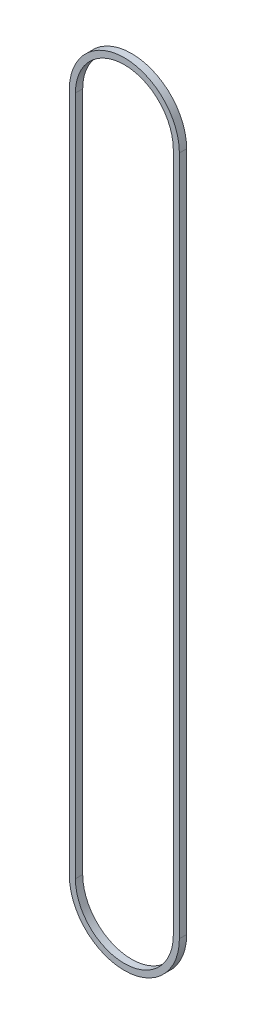
ISO-10303-21;
HEADER;
FILE_DESCRIPTION(('STEP AP214'),'2;1');
FILE_NAME('part.step','',(''),(''),'','','');
FILE_SCHEMA(('AUTOMOTIVE_DESIGN { 1 0 10303 214 1 1 1 1 }'));
ENDSEC;
DATA;
#1=APPLICATION_CONTEXT('core data for automotive mechanical design processes');
#2=APPLICATION_PROTOCOL_DEFINITION('international standard','automotive_design',2000,#1);
#3=PRODUCT_CONTEXT('',#1,'mechanical');
#4=PRODUCT('Part','Part','',(#3));
#5=PRODUCT_RELATED_PRODUCT_CATEGORY('part','',(#4));
#6=PRODUCT_DEFINITION_FORMATION('','',#4);
#7=PRODUCT_DEFINITION_CONTEXT('part definition',#1,'design');
#8=PRODUCT_DEFINITION('design','',#6,#7);
#9=PRODUCT_DEFINITION_SHAPE('','',#8);
#10=(LENGTH_UNIT() NAMED_UNIT(*) SI_UNIT(.MILLI.,.METRE.));
#11=(NAMED_UNIT(*) PLANE_ANGLE_UNIT() SI_UNIT($,.RADIAN.));
#12=(NAMED_UNIT(*) SI_UNIT($,.STERADIAN.) SOLID_ANGLE_UNIT());
#13=UNCERTAINTY_MEASURE_WITH_UNIT(LENGTH_MEASURE(1.E-05),#10,'distance_accuracy_value','');
#14=(GEOMETRIC_REPRESENTATION_CONTEXT(3) GLOBAL_UNCERTAINTY_ASSIGNED_CONTEXT((#13)) GLOBAL_UNIT_ASSIGNED_CONTEXT((#10,
#11,#12)) REPRESENTATION_CONTEXT('',''));
#15=CARTESIAN_POINT('',(0.,0.,0.));
#16=DIRECTION('',(0.,0.,1.));
#17=DIRECTION('',(1.,0.,0.));
#18=AXIS2_PLACEMENT_3D('',#15,#16,#17);
#19=CARTESIAN_POINT('',(0.,0.,7.62));
#20=DIRECTION('',(0.,0.,1.));
#21=DIRECTION('',(1.,0.,0.));
#22=AXIS2_PLACEMENT_3D('',#19,#20,#21);
#23=PLANE('',#22);
#24=CARTESIAN_POINT('',(0.,0.,7.62));
#25=DIRECTION('',(0.,0.,1.));
#26=DIRECTION('',(1.,0.,0.));
#27=AXIS2_PLACEMENT_3D('',#24,#25,#26);
#28=CIRCLE('',#27,57.4929);
#29=CARTESIAN_POINT('',(-57.4929,0.,7.62));
#30=VERTEX_POINT('',#29);
#31=CARTESIAN_POINT('',(57.4929,0.,7.62));
#32=VERTEX_POINT('',#31);
#33=EDGE_CURVE('E159',#30,#32,#28,.T.);
#34=ORIENTED_EDGE('',*,*,#33,.T.);
#35=DIRECTION('',(0.,1.,0.));
#36=VECTOR('',#35,1.);
#37=CARTESIAN_POINT('',(57.4929,0.,7.62));
#38=LINE('',#37,#36);
#39=CARTESIAN_POINT('',(57.4929,711.2,7.62));
#40=VERTEX_POINT('',#39);
#41=EDGE_CURVE('E163',#32,#40,#38,.T.);
#42=ORIENTED_EDGE('',*,*,#41,.T.);
#43=CARTESIAN_POINT('',(0.,711.2,7.62));
#44=DIRECTION('',(0.,0.,1.));
#45=DIRECTION('',(1.,0.,0.));
#46=AXIS2_PLACEMENT_3D('',#43,#44,#45);
#47=CIRCLE('',#46,57.4929);
#48=CARTESIAN_POINT('',(-57.4929,711.2,7.62));
#49=VERTEX_POINT('',#48);
#50=EDGE_CURVE('E167',#40,#49,#47,.T.);
#51=ORIENTED_EDGE('',*,*,#50,.T.);
#52=DIRECTION('',(0.,-1.,0.));
#53=VECTOR('',#52,1.);
#54=CARTESIAN_POINT('',(-57.4929,0.,7.62));
#55=LINE('',#54,#53);
#56=EDGE_CURVE('E170',#49,#30,#55,.T.);
#57=ORIENTED_EDGE('',*,*,#56,.T.);
#58=EDGE_LOOP('',(#34,#42,#51,#57));
#59=FACE_BOUND('',#58,.T.);
#60=DIRECTION('',(0.,1.,0.));
#61=VECTOR('',#60,1.);
#62=CARTESIAN_POINT('',(51.1429,0.,7.62));
#63=LINE('',#62,#61);
#64=CARTESIAN_POINT('',(51.1429,0.,7.62));
#65=VERTEX_POINT('',#64);
#66=CARTESIAN_POINT('',(51.1429,711.2,7.62));
#67=VERTEX_POINT('',#66);
#68=EDGE_CURVE('E120',#65,#67,#63,.T.);
#69=ORIENTED_EDGE('',*,*,#68,.F.);
#70=CARTESIAN_POINT('',(0.,0.,7.62));
#71=DIRECTION('',(0.,0.,1.));
#72=DIRECTION('',(1.,0.,0.));
#73=AXIS2_PLACEMENT_3D('',#70,#71,#72);
#74=CIRCLE('',#73,51.1429);
#75=CARTESIAN_POINT('',(-51.1429,0.,7.62));
#76=VERTEX_POINT('',#75);
#77=EDGE_CURVE('E111',#76,#65,#74,.T.);
#78=ORIENTED_EDGE('',*,*,#77,.F.);
#79=DIRECTION('',(0.,-1.,0.));
#80=VECTOR('',#79,1.);
#81=CARTESIAN_POINT('',(-51.1429,0.,7.62));
#82=LINE('',#81,#80);
#83=CARTESIAN_POINT('',(-51.1429,711.2,7.62));
#84=VERTEX_POINT('',#83);
#85=EDGE_CURVE('E137',#84,#76,#82,.T.);
#86=ORIENTED_EDGE('',*,*,#85,.F.);
#87=CARTESIAN_POINT('',(0.,711.2,7.62));
#88=DIRECTION('',(0.,0.,1.));
#89=DIRECTION('',(1.,0.,0.));
#90=AXIS2_PLACEMENT_3D('',#87,#88,#89);
#91=CIRCLE('',#90,51.1429);
#92=EDGE_CURVE('E133',#67,#84,#91,.T.);
#93=ORIENTED_EDGE('',*,*,#92,.F.);
#94=EDGE_LOOP('',(#69,#78,#86,#93));
#95=FACE_BOUND('',#94,.T.);
#96=ADVANCED_FACE('F45',(#59,#95),#23,.T.);
#97=CARTESIAN_POINT('',(0.,0.,0.));
#98=DIRECTION('',(0.,0.,1.));
#99=DIRECTION('',(1.,0.,0.));
#100=AXIS2_PLACEMENT_3D('',#97,#98,#99);
#101=PLANE('',#100);
#102=CARTESIAN_POINT('',(0.,0.,0.));
#103=DIRECTION('',(0.,0.,1.));
#104=DIRECTION('',(1.,0.,0.));
#105=AXIS2_PLACEMENT_3D('',#102,#103,#104);
#106=CIRCLE('',#105,57.4929);
#107=CARTESIAN_POINT('',(-57.4929,0.,0.));
#108=VERTEX_POINT('',#107);
#109=CARTESIAN_POINT('',(57.4929,0.,0.));
#110=VERTEX_POINT('',#109);
#111=EDGE_CURVE('E129',#108,#110,#106,.T.);
#112=ORIENTED_EDGE('',*,*,#111,.F.);
#113=DIRECTION('',(0.,-1.,0.));
#114=VECTOR('',#113,1.);
#115=CARTESIAN_POINT('',(-57.4929,0.,0.));
#116=LINE('',#115,#114);
#117=CARTESIAN_POINT('',(-57.4929,711.2,0.));
#118=VERTEX_POINT('',#117);
#119=EDGE_CURVE('E164',#118,#108,#116,.T.);
#120=ORIENTED_EDGE('',*,*,#119,.F.);
#121=CARTESIAN_POINT('',(0.,711.2,0.));
#122=DIRECTION('',(0.,0.,1.));
#123=DIRECTION('',(1.,0.,0.));
#124=AXIS2_PLACEMENT_3D('',#121,#122,#123);
#125=CIRCLE('',#124,57.4929);
#126=CARTESIAN_POINT('',(57.4929,711.2,0.));
#127=VERTEX_POINT('',#126);
#128=EDGE_CURVE('E180',#127,#118,#125,.T.);
#129=ORIENTED_EDGE('',*,*,#128,.F.);
#130=DIRECTION('',(0.,1.,0.));
#131=VECTOR('',#130,1.);
#132=CARTESIAN_POINT('',(57.4929,0.,0.));
#133=LINE('',#132,#131);
#134=EDGE_CURVE('E177',#110,#127,#133,.T.);
#135=ORIENTED_EDGE('',*,*,#134,.F.);
#136=EDGE_LOOP('',(#112,#120,#129,#135));
#137=FACE_BOUND('',#136,.T.);
#138=CARTESIAN_POINT('',(0.,0.,0.));
#139=DIRECTION('',(0.,0.,1.));
#140=DIRECTION('',(1.,0.,0.));
#141=AXIS2_PLACEMENT_3D('',#138,#139,#140);
#142=CIRCLE('',#141,51.1429);
#143=CARTESIAN_POINT('',(-51.1429,0.,0.));
#144=VERTEX_POINT('',#143);
#145=CARTESIAN_POINT('',(51.1429,0.,0.));
#146=VERTEX_POINT('',#145);
#147=EDGE_CURVE('E69',#144,#146,#142,.T.);
#148=ORIENTED_EDGE('',*,*,#147,.T.);
#149=DIRECTION('',(0.,1.,0.));
#150=VECTOR('',#149,1.);
#151=CARTESIAN_POINT('',(51.1429,0.,0.));
#152=LINE('',#151,#150);
#153=CARTESIAN_POINT('',(51.1429,711.2,0.));
#154=VERTEX_POINT('',#153);
#155=EDGE_CURVE('E127',#146,#154,#152,.T.);
#156=ORIENTED_EDGE('',*,*,#155,.T.);
#157=CARTESIAN_POINT('',(0.,711.2,0.));
#158=DIRECTION('',(0.,0.,1.));
#159=DIRECTION('',(1.,0.,0.));
#160=AXIS2_PLACEMENT_3D('',#157,#158,#159);
#161=CIRCLE('',#160,51.1429);
#162=CARTESIAN_POINT('',(-51.1429,711.2,0.));
#163=VERTEX_POINT('',#162);
#164=EDGE_CURVE('E146',#154,#163,#161,.T.);
#165=ORIENTED_EDGE('',*,*,#164,.T.);
#166=DIRECTION('',(0.,-1.,0.));
#167=VECTOR('',#166,1.);
#168=CARTESIAN_POINT('',(-51.1429,0.,0.));
#169=LINE('',#168,#167);
#170=EDGE_CURVE('E121',#163,#144,#169,.T.);
#171=ORIENTED_EDGE('',*,*,#170,.T.);
#172=EDGE_LOOP('',(#148,#156,#165,#171));
#173=FACE_BOUND('',#172,.T.);
#174=ADVANCED_FACE('F203',(#137,#173),#101,.F.);
#175=CARTESIAN_POINT('',(0.,0.,7.62));
#176=DIRECTION('',(0.,0.,-1.));
#177=DIRECTION('',(-1.,0.,0.));
#178=AXIS2_PLACEMENT_3D('',#175,#176,#177);
#179=CYLINDRICAL_SURFACE('',#178,57.4929);
#180=ORIENTED_EDGE('',*,*,#111,.T.);
#181=DIRECTION('',(0.,0.,-1.));
#182=VECTOR('',#181,1.);
#183=CARTESIAN_POINT('',(57.4929,0.,7.62));
#184=LINE('',#183,#182);
#185=EDGE_CURVE('E11',#32,#110,#184,.T.);
#186=ORIENTED_EDGE('',*,*,#185,.F.);
#187=ORIENTED_EDGE('',*,*,#33,.F.);
#188=DIRECTION('',(0.,0.,-1.));
#189=VECTOR('',#188,1.);
#190=CARTESIAN_POINT('',(-57.4929,0.,7.62));
#191=LINE('',#190,#189);
#192=EDGE_CURVE('E173',#30,#108,#191,.T.);
#193=ORIENTED_EDGE('',*,*,#192,.T.);
#194=EDGE_LOOP('',(#180,#186,#187,#193));
#195=FACE_BOUND('',#194,.T.);
#196=ADVANCED_FACE('F47',(#195),#179,.T.);
#197=CARTESIAN_POINT('',(57.4929,0.,7.62));
#198=DIRECTION('',(-1.,0.,0.));
#199=DIRECTION('',(0.,0.,1.));
#200=AXIS2_PLACEMENT_3D('',#197,#198,#199);
#201=PLANE('',#200);
#202=ORIENTED_EDGE('',*,*,#134,.T.);
#203=DIRECTION('',(0.,0.,-1.));
#204=VECTOR('',#203,1.);
#205=CARTESIAN_POINT('',(57.4929,711.2,7.62));
#206=LINE('',#205,#204);
#207=EDGE_CURVE('E54',#40,#127,#206,.T.);
#208=ORIENTED_EDGE('',*,*,#207,.F.);
#209=ORIENTED_EDGE('',*,*,#41,.F.);
#210=ORIENTED_EDGE('',*,*,#185,.T.);
#211=EDGE_LOOP('',(#202,#208,#209,#210));
#212=FACE_BOUND('',#211,.T.);
#213=ADVANCED_FACE('F213',(#212),#201,.F.);
#214=CARTESIAN_POINT('',(0.,711.2,7.62));
#215=DIRECTION('',(0.,0.,-1.));
#216=DIRECTION('',(-1.,0.,0.));
#217=AXIS2_PLACEMENT_3D('',#214,#215,#216);
#218=CYLINDRICAL_SURFACE('',#217,57.4929);
#219=ORIENTED_EDGE('',*,*,#128,.T.);
#220=DIRECTION('',(0.,0.,-1.));
#221=VECTOR('',#220,1.);
#222=CARTESIAN_POINT('',(-57.4929,711.2,7.62));
#223=LINE('',#222,#221);
#224=EDGE_CURVE('E188',#49,#118,#223,.T.);
#225=ORIENTED_EDGE('',*,*,#224,.F.);
#226=ORIENTED_EDGE('',*,*,#50,.F.);
#227=ORIENTED_EDGE('',*,*,#207,.T.);
#228=EDGE_LOOP('',(#219,#225,#226,#227));
#229=FACE_BOUND('',#228,.T.);
#230=ADVANCED_FACE('F197',(#229),#218,.T.);
#231=CARTESIAN_POINT('',(-57.4929,0.,7.62));
#232=DIRECTION('',(1.,0.,0.));
#233=DIRECTION('',(0.,0.,-1.));
#234=AXIS2_PLACEMENT_3D('',#231,#232,#233);
#235=PLANE('',#234);
#236=ORIENTED_EDGE('',*,*,#119,.T.);
#237=ORIENTED_EDGE('',*,*,#192,.F.);
#238=ORIENTED_EDGE('',*,*,#56,.F.);
#239=ORIENTED_EDGE('',*,*,#224,.T.);
#240=EDGE_LOOP('',(#236,#237,#238,#239));
#241=FACE_BOUND('',#240,.T.);
#242=ADVANCED_FACE('F207',(#241),#235,.F.);
#243=CARTESIAN_POINT('',(0.,0.,7.62));
#244=DIRECTION('',(0.,0.,-1.));
#245=DIRECTION('',(-1.,0.,0.));
#246=AXIS2_PLACEMENT_3D('',#243,#244,#245);
#247=CYLINDRICAL_SURFACE('',#246,51.1429);
#248=ORIENTED_EDGE('',*,*,#147,.F.);
#249=DIRECTION('',(0.,0.,-1.));
#250=VECTOR('',#249,1.);
#251=CARTESIAN_POINT('',(-51.1429,0.,7.62));
#252=LINE('',#251,#250);
#253=EDGE_CURVE('E115',#76,#144,#252,.T.);
#254=ORIENTED_EDGE('',*,*,#253,.F.);
#255=ORIENTED_EDGE('',*,*,#77,.T.);
#256=DIRECTION('',(0.,0.,-1.));
#257=VECTOR('',#256,1.);
#258=CARTESIAN_POINT('',(51.1429,0.,7.62));
#259=LINE('',#258,#257);
#260=EDGE_CURVE('E114',#65,#146,#259,.T.);
#261=ORIENTED_EDGE('',*,*,#260,.T.);
#262=EDGE_LOOP('',(#248,#254,#255,#261));
#263=FACE_BOUND('',#262,.T.);
#264=ADVANCED_FACE('F113',(#263),#247,.F.);
#265=CARTESIAN_POINT('',(51.1429,0.,7.62));
#266=DIRECTION('',(-1.,0.,0.));
#267=DIRECTION('',(0.,0.,1.));
#268=AXIS2_PLACEMENT_3D('',#265,#266,#267);
#269=PLANE('',#268);
#270=ORIENTED_EDGE('',*,*,#155,.F.);
#271=ORIENTED_EDGE('',*,*,#260,.F.);
#272=ORIENTED_EDGE('',*,*,#68,.T.);
#273=DIRECTION('',(0.,0.,-1.));
#274=VECTOR('',#273,1.);
#275=CARTESIAN_POINT('',(51.1429,711.2,7.62));
#276=LINE('',#275,#274);
#277=EDGE_CURVE('E130',#67,#154,#276,.T.);
#278=ORIENTED_EDGE('',*,*,#277,.T.);
#279=EDGE_LOOP('',(#270,#271,#272,#278));
#280=FACE_BOUND('',#279,.T.);
#281=ADVANCED_FACE('F124',(#280),#269,.T.);
#282=CARTESIAN_POINT('',(0.,711.2,7.62));
#283=DIRECTION('',(0.,0.,-1.));
#284=DIRECTION('',(-1.,0.,0.));
#285=AXIS2_PLACEMENT_3D('',#282,#283,#284);
#286=CYLINDRICAL_SURFACE('',#285,51.1429);
#287=ORIENTED_EDGE('',*,*,#164,.F.);
#288=ORIENTED_EDGE('',*,*,#277,.F.);
#289=ORIENTED_EDGE('',*,*,#92,.T.);
#290=DIRECTION('',(0.,0.,-1.));
#291=VECTOR('',#290,1.);
#292=CARTESIAN_POINT('',(-51.1429,711.2,7.62));
#293=LINE('',#292,#291);
#294=EDGE_CURVE('E61',#84,#163,#293,.T.);
#295=ORIENTED_EDGE('',*,*,#294,.T.);
#296=EDGE_LOOP('',(#287,#288,#289,#295));
#297=FACE_BOUND('',#296,.T.);
#298=ADVANCED_FACE('F236',(#297),#286,.F.);
#299=CARTESIAN_POINT('',(-51.1429,0.,7.62));
#300=DIRECTION('',(1.,0.,0.));
#301=DIRECTION('',(0.,0.,-1.));
#302=AXIS2_PLACEMENT_3D('',#299,#300,#301);
#303=PLANE('',#302);
#304=ORIENTED_EDGE('',*,*,#170,.F.);
#305=ORIENTED_EDGE('',*,*,#294,.F.);
#306=ORIENTED_EDGE('',*,*,#85,.T.);
#307=ORIENTED_EDGE('',*,*,#253,.T.);
#308=EDGE_LOOP('',(#304,#305,#306,#307));
#309=FACE_BOUND('',#308,.T.);
#310=ADVANCED_FACE('F240',(#309),#303,.T.);
#311=CLOSED_SHELL('',(#96,#174,#196,#213,#230,#242,#264,#281,#298,#310));
#312=MANIFOLD_SOLID_BREP('B2',#311);
#313=ADVANCED_BREP_SHAPE_REPRESENTATION('',(#18,#312),#14);
#314=SHAPE_DEFINITION_REPRESENTATION(#9,#313);
ENDSEC;
END-ISO-10303-21;
